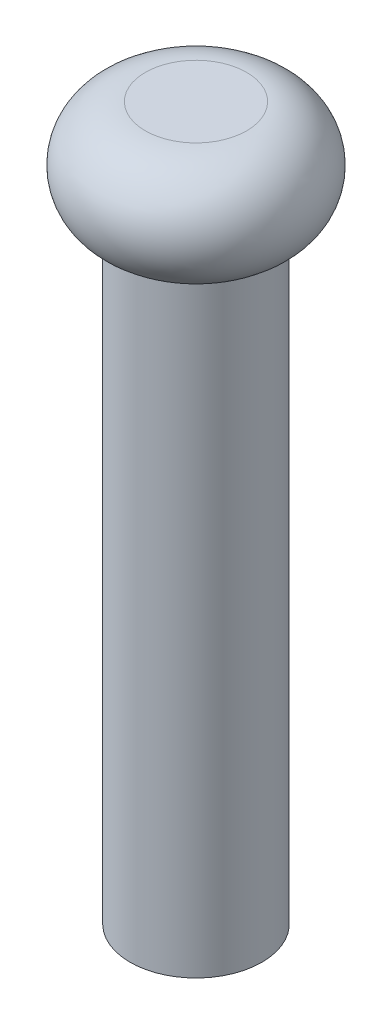
ISO-10303-21;
HEADER;
FILE_DESCRIPTION(('STEP AP214'),'2;1');
FILE_NAME('part.step','',(''),(''),'','','');
FILE_SCHEMA(('AUTOMOTIVE_DESIGN { 1 0 10303 214 1 1 1 1 }'));
ENDSEC;
DATA;
#1=APPLICATION_CONTEXT('core data for automotive mechanical design processes');
#2=APPLICATION_PROTOCOL_DEFINITION('international standard','automotive_design',2000,#1);
#3=PRODUCT_CONTEXT('',#1,'mechanical');
#4=PRODUCT('Part','Part','',(#3));
#5=PRODUCT_RELATED_PRODUCT_CATEGORY('part','',(#4));
#6=PRODUCT_DEFINITION_FORMATION('','',#4);
#7=PRODUCT_DEFINITION_CONTEXT('part definition',#1,'design');
#8=PRODUCT_DEFINITION('design','',#6,#7);
#9=PRODUCT_DEFINITION_SHAPE('','',#8);
#10=(LENGTH_UNIT() NAMED_UNIT(*) SI_UNIT(.MILLI.,.METRE.));
#11=(NAMED_UNIT(*) PLANE_ANGLE_UNIT() SI_UNIT($,.RADIAN.));
#12=(NAMED_UNIT(*) SI_UNIT($,.STERADIAN.) SOLID_ANGLE_UNIT());
#13=UNCERTAINTY_MEASURE_WITH_UNIT(LENGTH_MEASURE(1.E-05),#10,'distance_accuracy_value','');
#14=(GEOMETRIC_REPRESENTATION_CONTEXT(3) GLOBAL_UNCERTAINTY_ASSIGNED_CONTEXT((#13)) GLOBAL_UNIT_ASSIGNED_CONTEXT((#10,
#11,#12)) REPRESENTATION_CONTEXT('',''));
#15=CARTESIAN_POINT('',(0.,0.,0.));
#16=DIRECTION('',(0.,0.,1.));
#17=DIRECTION('',(1.,0.,0.));
#18=AXIS2_PLACEMENT_3D('',#15,#16,#17);
#19=CARTESIAN_POINT('',(0.,0.,0.));
#20=DIRECTION('',(0.,-1.,0.));
#21=DIRECTION('',(1.,0.,0.));
#22=AXIS2_PLACEMENT_3D('',#19,#20,#21);
#23=PLANE('',#22);
#24=CARTESIAN_POINT('',(0.,0.,0.));
#25=DIRECTION('',(0.,-1.,0.));
#26=DIRECTION('',(1.,0.,0.));
#27=AXIS2_PLACEMENT_3D('',#24,#25,#26);
#28=CIRCLE('',#27,1.25);
#29=CARTESIAN_POINT('',(1.25,0.,0.));
#30=VERTEX_POINT('',#29);
#31=EDGE_CURVE('E10',#30,#30,#28,.T.);
#32=ORIENTED_EDGE('',*,*,#31,.T.);
#33=EDGE_LOOP('',(#32));
#34=FACE_BOUND('',#33,.T.);
#35=ADVANCED_FACE('F31',(#34),#23,.T.);
#36=CARTESIAN_POINT('',(3.44142146868977E-13,-100.325704338304,0.));
#37=DIRECTION('',(0.,-1.,0.));
#38=DIRECTION('',(1.,0.,0.));
#39=AXIS2_PLACEMENT_3D('',#36,#37,#38);
#40=CYLINDRICAL_SURFACE('',#39,1.25000000000002);
#41=CARTESIAN_POINT('',(0.,11.5,0.));
#42=DIRECTION('',(0.,-1.,0.));
#43=DIRECTION('',(1.,0.,0.));
#44=AXIS2_PLACEMENT_3D('',#41,#42,#43);
#45=CIRCLE('',#44,1.25000000000004);
#46=CARTESIAN_POINT('',(1.25,11.5,0.));
#47=VERTEX_POINT('',#46);
#48=EDGE_CURVE('E37',#47,#47,#45,.T.);
#49=ORIENTED_EDGE('',*,*,#48,.T.);
#50=EDGE_LOOP('',(#49));
#51=FACE_BOUND('',#50,.T.);
#52=ORIENTED_EDGE('',*,*,#31,.F.);
#53=EDGE_LOOP('',(#52));
#54=FACE_BOUND('',#53,.T.);
#55=ADVANCED_FACE('F63',(#51,#54),#40,.T.);
#56=CARTESIAN_POINT('',(1.25,11.5,0.));
#57=DIRECTION('',(0.,-1.,0.));
#58=DIRECTION('',(1.,0.,0.));
#59=AXIS2_PLACEMENT_3D('',#56,#57,#58);
#60=PLANE('',#59);
#61=CARTESIAN_POINT('',(0.,11.5,0.));
#62=DIRECTION('',(0.,-1.,0.));
#63=DIRECTION('',(1.,0.,0.));
#64=AXIS2_PLACEMENT_3D('',#61,#62,#63);
#65=CIRCLE('',#64,1.36000000000004);
#66=CARTESIAN_POINT('',(1.36,11.5,0.));
#67=VERTEX_POINT('',#66);
#68=EDGE_CURVE('E41',#67,#67,#65,.T.);
#69=ORIENTED_EDGE('',*,*,#68,.T.);
#70=EDGE_LOOP('',(#69));
#71=FACE_BOUND('',#70,.T.);
#72=ORIENTED_EDGE('',*,*,#48,.F.);
#73=EDGE_LOOP('',(#72));
#74=FACE_BOUND('',#73,.T.);
#75=ADVANCED_FACE('F60',(#71,#74),#60,.T.);
#76=CARTESIAN_POINT('',(0.,12.46,0.));
#77=DIRECTION('',(0.,-1.,0.));
#78=DIRECTION('',(1.,0.,0.));
#79=AXIS2_PLACEMENT_3D('',#76,#77,#78);
#80=DEGENERATE_TOROIDAL_SURFACE('',#79,0.960000000000043,1.04,.T.);
#81=CARTESIAN_POINT('',(0.,13.5,0.));
#82=DIRECTION('',(0.,-1.,0.));
#83=DIRECTION('',(1.,0.,0.));
#84=AXIS2_PLACEMENT_3D('',#81,#82,#83);
#85=CIRCLE('',#84,0.960000000000046);
#86=CARTESIAN_POINT('',(0.96,13.5,0.));
#87=VERTEX_POINT('',#86);
#88=EDGE_CURVE('E45',#87,#87,#85,.T.);
#89=ORIENTED_EDGE('',*,*,#88,.T.);
#90=EDGE_LOOP('',(#89));
#91=FACE_BOUND('',#90,.T.);
#92=ORIENTED_EDGE('',*,*,#68,.F.);
#93=EDGE_LOOP('',(#92));
#94=FACE_BOUND('',#93,.T.);
#95=ADVANCED_FACE('F51',(#91,#94),#80,.T.);
#96=CARTESIAN_POINT('',(0.96,13.5,0.));
#97=DIRECTION('',(0.,1.,0.));
#98=DIRECTION('',(-1.,0.,0.));
#99=AXIS2_PLACEMENT_3D('',#96,#97,#98);
#100=PLANE('',#99);
#101=ORIENTED_EDGE('',*,*,#88,.F.);
#102=EDGE_LOOP('',(#101));
#103=FACE_BOUND('',#102,.T.);
#104=ADVANCED_FACE('F54',(#103),#100,.T.);
#105=CLOSED_SHELL('',(#35,#55,#75,#95,#104));
#106=MANIFOLD_SOLID_BREP('B2',#105);
#107=ADVANCED_BREP_SHAPE_REPRESENTATION('',(#18,#106),#14);
#108=SHAPE_DEFINITION_REPRESENTATION(#9,#107);
ENDSEC;
END-ISO-10303-21;
